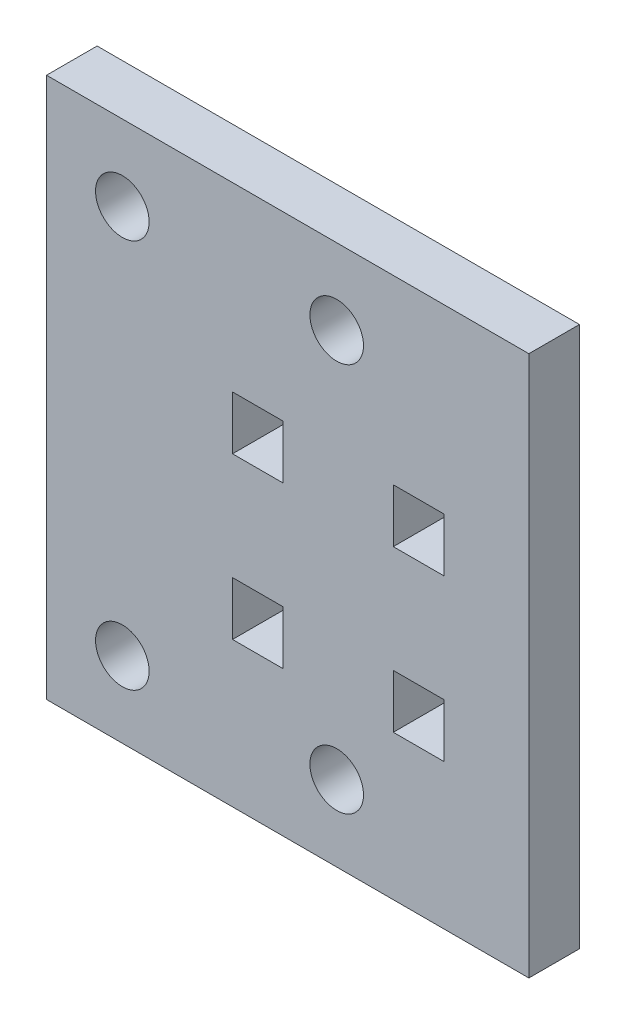
ISO-10303-21;
HEADER;
FILE_DESCRIPTION(('STEP AP214'),'2;1');
FILE_NAME('part.step','',(''),(''),'','','');
FILE_SCHEMA(('AUTOMOTIVE_DESIGN { 1 0 10303 214 1 1 1 1 }'));
ENDSEC;
DATA;
#1=APPLICATION_CONTEXT('core data for automotive mechanical design processes');
#2=APPLICATION_PROTOCOL_DEFINITION('international standard','automotive_design',2000,#1);
#3=PRODUCT_CONTEXT('',#1,'mechanical');
#4=PRODUCT('Part','Part','',(#3));
#5=PRODUCT_RELATED_PRODUCT_CATEGORY('part','',(#4));
#6=PRODUCT_DEFINITION_FORMATION('','',#4);
#7=PRODUCT_DEFINITION_CONTEXT('part definition',#1,'design');
#8=PRODUCT_DEFINITION('design','',#6,#7);
#9=PRODUCT_DEFINITION_SHAPE('','',#8);
#10=(LENGTH_UNIT() NAMED_UNIT(*) SI_UNIT(.MILLI.,.METRE.));
#11=(NAMED_UNIT(*) PLANE_ANGLE_UNIT() SI_UNIT($,.RADIAN.));
#12=(NAMED_UNIT(*) SI_UNIT($,.STERADIAN.) SOLID_ANGLE_UNIT());
#13=UNCERTAINTY_MEASURE_WITH_UNIT(LENGTH_MEASURE(1.E-05),#10,'distance_accuracy_value','');
#14=(GEOMETRIC_REPRESENTATION_CONTEXT(3) GLOBAL_UNCERTAINTY_ASSIGNED_CONTEXT((#13)) GLOBAL_UNIT_ASSIGNED_CONTEXT((#10,
#11,#12)) REPRESENTATION_CONTEXT('',''));
#15=CARTESIAN_POINT('',(0.,0.,0.));
#16=DIRECTION('',(0.,0.,1.));
#17=DIRECTION('',(1.,0.,0.));
#18=AXIS2_PLACEMENT_3D('',#15,#16,#17);
#19=CARTESIAN_POINT('',(0.,0.,5.9944));
#20=DIRECTION('',(0.,0.,-1.));
#21=DIRECTION('',(-1.,0.,0.));
#22=AXIS2_PLACEMENT_3D('',#19,#20,#21);
#23=PLANE('',#22);
#24=DIRECTION('',(0.,1.,0.));
#25=VECTOR('',#24,1.);
#26=CARTESIAN_POINT('',(-34.0795799365891,11.8820184368351,5.9944));
#27=LINE('',#26,#25);
#28=CARTESIAN_POINT('',(-34.0795799365891,5.53201843683511,5.9944));
#29=VERTEX_POINT('',#28);
#30=CARTESIAN_POINT('',(-34.0795799365891,11.8820184368351,5.9944));
#31=VERTEX_POINT('',#30);
#32=EDGE_CURVE('E204',#29,#31,#27,.T.);
#33=ORIENTED_EDGE('',*,*,#32,.F.);
#34=DIRECTION('',(1.,0.,0.));
#35=VECTOR('',#34,1.);
#36=CARTESIAN_POINT('',(-34.0795799365891,5.53201843683511,5.9944));
#37=LINE('',#36,#35);
#38=CARTESIAN_POINT('',(-40.0739799365892,5.53201843683511,5.9944));
#39=VERTEX_POINT('',#38);
#40=EDGE_CURVE('E212',#39,#29,#37,.T.);
#41=ORIENTED_EDGE('',*,*,#40,.F.);
#42=DIRECTION('',(0.,-1.,0.));
#43=VECTOR('',#42,1.);
#44=CARTESIAN_POINT('',(-40.0739799365892,5.53201843683511,5.9944));
#45=LINE('',#44,#43);
#46=CARTESIAN_POINT('',(-40.0739799365892,11.8820184368351,5.9944));
#47=VERTEX_POINT('',#46);
#48=EDGE_CURVE('E209',#47,#39,#45,.T.);
#49=ORIENTED_EDGE('',*,*,#48,.F.);
#50=DIRECTION('',(-1.,0.,0.));
#51=VECTOR('',#50,1.);
#52=CARTESIAN_POINT('',(-40.0739799365892,11.8820184368351,5.9944));
#53=LINE('',#52,#51);
#54=EDGE_CURVE('E206',#31,#47,#53,.T.);
#55=ORIENTED_EDGE('',*,*,#54,.F.);
#56=EDGE_LOOP('',(#33,#41,#49,#55));
#57=FACE_BOUND('',#56,.T.);
#58=CARTESIAN_POINT('',(-27.7295799365893,-21.71894001958,5.9944));
#59=DIRECTION('',(0.,0.,1.));
#60=DIRECTION('',(1.,0.,0.));
#61=AXIS2_PLACEMENT_3D('',#58,#59,#60);
#62=CIRCLE('',#61,3.175);
#63=CARTESIAN_POINT('',(-24.5545799365893,-21.71894001958,5.9944));
#64=VERTEX_POINT('',#63);
#65=EDGE_CURVE('E266',#64,#64,#62,.T.);
#66=ORIENTED_EDGE('',*,*,#65,.F.);
#67=EDGE_LOOP('',(#66));
#68=FACE_BOUND('',#67,.T.);
#69=CARTESIAN_POINT('',(-27.7295799365893,24.38105998042,5.9944));
#70=DIRECTION('',(0.,0.,1.));
#71=DIRECTION('',(1.,0.,0.));
#72=AXIS2_PLACEMENT_3D('',#69,#70,#71);
#73=CIRCLE('',#72,3.175);
#74=CARTESIAN_POINT('',(-24.5545799365893,24.38105998042,5.9944));
#75=VERTEX_POINT('',#74);
#76=EDGE_CURVE('E272',#75,#75,#73,.T.);
#77=ORIENTED_EDGE('',*,*,#76,.F.);
#78=EDGE_LOOP('',(#77));
#79=FACE_BOUND('',#78,.T.);
#80=CARTESIAN_POINT('',(-53.1295799365893,-21.71894001958,5.9944));
#81=DIRECTION('',(0.,0.,1.));
#82=DIRECTION('',(1.,0.,0.));
#83=AXIS2_PLACEMENT_3D('',#80,#81,#82);
#84=CIRCLE('',#83,3.175);
#85=CARTESIAN_POINT('',(-49.9545799365893,-21.71894001958,5.9944));
#86=VERTEX_POINT('',#85);
#87=EDGE_CURVE('E278',#86,#86,#84,.T.);
#88=ORIENTED_EDGE('',*,*,#87,.F.);
#89=EDGE_LOOP('',(#88));
#90=FACE_BOUND('',#89,.T.);
#91=CARTESIAN_POINT('',(-53.1295799365893,24.38105998042,5.9944));
#92=DIRECTION('',(0.,0.,1.));
#93=DIRECTION('',(1.,0.,0.));
#94=AXIS2_PLACEMENT_3D('',#91,#92,#93);
#95=CIRCLE('',#94,3.175);
#96=CARTESIAN_POINT('',(-49.9545799365893,24.38105998042,5.9944));
#97=VERTEX_POINT('',#96);
#98=EDGE_CURVE('E284',#97,#97,#95,.T.);
#99=ORIENTED_EDGE('',*,*,#98,.F.);
#100=EDGE_LOOP('',(#99));
#101=FACE_BOUND('',#100,.T.);
#102=DIRECTION('',(0.,1.,0.));
#103=VECTOR('',#102,1.);
#104=CARTESIAN_POINT('',(-15.0295799365894,-13.5179815627692,5.9944));
#105=LINE('',#104,#103);
#106=CARTESIAN_POINT('',(-15.0295799365894,-13.5179815627692,5.9944));
#107=VERTEX_POINT('',#106);
#108=CARTESIAN_POINT('',(-15.0295799365626,-7.1679815631649,5.9944));
#109=VERTEX_POINT('',#108);
#110=EDGE_CURVE('E290',#107,#109,#105,.T.);
#111=ORIENTED_EDGE('',*,*,#110,.F.);
#112=DIRECTION('',(1.,0.,0.));
#113=VECTOR('',#112,1.);
#114=CARTESIAN_POINT('',(-15.0295799365894,-13.5179815627692,5.9944));
#115=LINE('',#114,#113);
#116=CARTESIAN_POINT('',(-21.0239799365894,-13.5179815627692,5.9944));
#117=VERTEX_POINT('',#116);
#118=EDGE_CURVE('E298',#117,#107,#115,.T.);
#119=ORIENTED_EDGE('',*,*,#118,.F.);
#120=DIRECTION('',(-1.33178340761545E-10,-1.,0.));
#121=VECTOR('',#120,1.);
#122=CARTESIAN_POINT('',(-21.0239799365894,-7.36894001958005,5.9944));
#123=LINE('',#122,#121);
#124=CARTESIAN_POINT('',(-21.0239799365626,-7.1679815631649,5.9944));
#125=VERTEX_POINT('',#124);
#126=EDGE_CURVE('E295',#125,#117,#123,.T.);
#127=ORIENTED_EDGE('',*,*,#126,.F.);
#128=DIRECTION('',(-1.,0.,0.));
#129=VECTOR('',#128,1.);
#130=CARTESIAN_POINT('',(-15.0295799365626,-7.1679815631649,5.9944));
#131=LINE('',#130,#129);
#132=EDGE_CURVE('E292',#109,#125,#131,.T.);
#133=ORIENTED_EDGE('',*,*,#132,.F.);
#134=EDGE_LOOP('',(#111,#119,#127,#133));
#135=FACE_BOUND('',#134,.T.);
#136=DIRECTION('',(0.,1.,0.));
#137=VECTOR('',#136,1.);
#138=CARTESIAN_POINT('',(-4.95983605765846,33.3613161014891,5.9944));
#139=LINE('',#138,#137);
#140=CARTESIAN_POINT('',(-4.95983605765846,-30.6991961406492,5.9944));
#141=VERTEX_POINT('',#140);
#142=CARTESIAN_POINT('',(-4.95983605765846,33.3613161014891,5.9944));
#143=VERTEX_POINT('',#142);
#144=EDGE_CURVE('E320',#141,#143,#139,.T.);
#145=ORIENTED_EDGE('',*,*,#144,.T.);
#146=DIRECTION('',(-1.,0.,0.));
#147=VECTOR('',#146,1.);
#148=CARTESIAN_POINT('',(-62.1098360576585,33.3613161014891,5.9944));
#149=LINE('',#148,#147);
#150=CARTESIAN_POINT('',(-62.1098360576585,33.3613161014891,5.9944));
#151=VERTEX_POINT('',#150);
#152=EDGE_CURVE('E323',#143,#151,#149,.T.);
#153=ORIENTED_EDGE('',*,*,#152,.T.);
#154=DIRECTION('',(0.,-1.,0.));
#155=VECTOR('',#154,1.);
#156=CARTESIAN_POINT('',(-62.1098360576584,-30.6991961406492,5.9944));
#157=LINE('',#156,#155);
#158=CARTESIAN_POINT('',(-62.1098360576584,-30.6991961406492,5.9944));
#159=VERTEX_POINT('',#158);
#160=EDGE_CURVE('E326',#151,#159,#157,.T.);
#161=ORIENTED_EDGE('',*,*,#160,.T.);
#162=DIRECTION('',(1.,0.,0.));
#163=VECTOR('',#162,1.);
#164=CARTESIAN_POINT('',(-4.95983605765846,-30.6991961406492,5.9944));
#165=LINE('',#164,#163);
#166=EDGE_CURVE('E328',#159,#141,#165,.T.);
#167=ORIENTED_EDGE('',*,*,#166,.T.);
#168=EDGE_LOOP('',(#145,#153,#161,#167));
#169=FACE_BOUND('',#168,.T.);
#170=DIRECTION('',(-1.,0.,0.));
#171=VECTOR('',#170,1.);
#172=CARTESIAN_POINT('',(-15.0295799365626,11.8820184368351,5.9944));
#173=LINE('',#172,#171);
#174=CARTESIAN_POINT('',(-15.0295799365626,11.8820184368351,5.9944));
#175=VERTEX_POINT('',#174);
#176=CARTESIAN_POINT('',(-21.0239799365895,11.8820184368351,5.9944));
#177=VERTEX_POINT('',#176);
#178=EDGE_CURVE('E235',#175,#177,#173,.T.);
#179=ORIENTED_EDGE('',*,*,#178,.F.);
#180=DIRECTION('',(0.,1.,0.));
#181=VECTOR('',#180,1.);
#182=CARTESIAN_POINT('',(-15.0295799365626,5.53201843683511,5.9944));
#183=LINE('',#182,#181);
#184=CARTESIAN_POINT('',(-15.0295799365626,5.53201843683511,5.9944));
#185=VERTEX_POINT('',#184);
#186=EDGE_CURVE('E243',#185,#175,#183,.T.);
#187=ORIENTED_EDGE('',*,*,#186,.F.);
#188=DIRECTION('',(1.,0.,0.));
#189=VECTOR('',#188,1.);
#190=CARTESIAN_POINT('',(-21.0239799365626,5.53201843683511,5.9944));
#191=LINE('',#190,#189);
#192=CARTESIAN_POINT('',(-21.0239799365626,5.53201843683511,5.9944));
#193=VERTEX_POINT('',#192);
#194=EDGE_CURVE('E240',#193,#185,#191,.T.);
#195=ORIENTED_EDGE('',*,*,#194,.F.);
#196=DIRECTION('',(4.23217891178468E-12,-1.,0.));
#197=VECTOR('',#196,1.);
#198=CARTESIAN_POINT('',(-21.0239799365895,11.8820184368351,5.9944));
#199=LINE('',#198,#197);
#200=EDGE_CURVE('E237',#177,#193,#199,.T.);
#201=ORIENTED_EDGE('',*,*,#200,.F.);
#202=EDGE_LOOP('',(#179,#187,#195,#201));
#203=FACE_BOUND('',#202,.T.);
#204=DIRECTION('',(1.,0.,0.));
#205=VECTOR('',#204,1.);
#206=CARTESIAN_POINT('',(-40.0739799365892,-13.5179815627692,5.9944));
#207=LINE('',#206,#205);
#208=CARTESIAN_POINT('',(-40.0739799365892,-13.5179815627692,5.9944));
#209=VERTEX_POINT('',#208);
#210=CARTESIAN_POINT('',(-34.0795799365892,-13.5179815627692,5.9944));
#211=VERTEX_POINT('',#210);
#212=EDGE_CURVE('E172',#209,#211,#207,.T.);
#213=ORIENTED_EDGE('',*,*,#212,.F.);
#214=DIRECTION('',(0.,-1.,0.));
#215=VECTOR('',#214,1.);
#216=CARTESIAN_POINT('',(-40.0739799365892,-13.5179815627692,5.9944));
#217=LINE('',#216,#215);
#218=CARTESIAN_POINT('',(-40.0739799365891,-7.16798156276918,5.9944));
#219=VERTEX_POINT('',#218);
#220=EDGE_CURVE('E167',#219,#209,#217,.T.);
#221=ORIENTED_EDGE('',*,*,#220,.F.);
#222=DIRECTION('',(-1.,0.,0.));
#223=VECTOR('',#222,1.);
#224=CARTESIAN_POINT('',(-40.0739799365891,-7.16798156276918,5.9944));
#225=LINE('',#224,#223);
#226=CARTESIAN_POINT('',(-34.0795799365891,-7.16798156276918,5.9944));
#227=VERTEX_POINT('',#226);
#228=EDGE_CURVE('E188',#227,#219,#225,.T.);
#229=ORIENTED_EDGE('',*,*,#228,.F.);
#230=DIRECTION('',(0.,1.,0.));
#231=VECTOR('',#230,1.);
#232=CARTESIAN_POINT('',(-34.0795799365892,-13.5179815627692,5.9944));
#233=LINE('',#232,#231);
#234=EDGE_CURVE('E186',#211,#227,#233,.T.);
#235=ORIENTED_EDGE('',*,*,#234,.F.);
#236=EDGE_LOOP('',(#213,#221,#229,#235));
#237=FACE_BOUND('',#236,.T.);
#238=ADVANCED_FACE('F33',(#57,#68,#79,#90,#101,#135,#169,#203,#237),#23,.F.);
#239=CARTESIAN_POINT('',(0.,0.,0.));
#240=DIRECTION('',(0.,0.,-1.));
#241=DIRECTION('',(-1.,0.,0.));
#242=AXIS2_PLACEMENT_3D('',#239,#240,#241);
#243=PLANE('',#242);
#244=CARTESIAN_POINT('',(-27.7295799365893,24.38105998042,0.));
#245=DIRECTION('',(0.,0.,1.));
#246=DIRECTION('',(1.,0.,0.));
#247=AXIS2_PLACEMENT_3D('',#244,#245,#246);
#248=CIRCLE('',#247,3.175);
#249=CARTESIAN_POINT('',(-24.5545799365893,24.38105998042,0.));
#250=VERTEX_POINT('',#249);
#251=EDGE_CURVE('E269',#250,#250,#248,.T.);
#252=ORIENTED_EDGE('',*,*,#251,.T.);
#253=EDGE_LOOP('',(#252));
#254=FACE_BOUND('',#253,.T.);
#255=CARTESIAN_POINT('',(-53.1295799365893,24.38105998042,0.));
#256=DIRECTION('',(0.,0.,1.));
#257=DIRECTION('',(1.,0.,0.));
#258=AXIS2_PLACEMENT_3D('',#255,#256,#257);
#259=CIRCLE('',#258,3.175);
#260=CARTESIAN_POINT('',(-49.9545799365893,24.38105998042,0.));
#261=VERTEX_POINT('',#260);
#262=EDGE_CURVE('E281',#261,#261,#259,.T.);
#263=ORIENTED_EDGE('',*,*,#262,.T.);
#264=EDGE_LOOP('',(#263));
#265=FACE_BOUND('',#264,.T.);
#266=DIRECTION('',(0.,1.,0.));
#267=VECTOR('',#266,1.);
#268=CARTESIAN_POINT('',(-4.95983605765846,33.3613161014891,0.));
#269=LINE('',#268,#267);
#270=CARTESIAN_POINT('',(-4.95983605765846,-30.6991961406492,0.));
#271=VERTEX_POINT('',#270);
#272=CARTESIAN_POINT('',(-4.95983605765846,33.3613161014891,0.));
#273=VERTEX_POINT('',#272);
#274=EDGE_CURVE('E319',#271,#273,#269,.T.);
#275=ORIENTED_EDGE('',*,*,#274,.F.);
#276=DIRECTION('',(1.,0.,0.));
#277=VECTOR('',#276,1.);
#278=CARTESIAN_POINT('',(-4.95983605765846,-30.6991961406492,0.));
#279=LINE('',#278,#277);
#280=CARTESIAN_POINT('',(-62.1098360576584,-30.6991961406492,0.));
#281=VERTEX_POINT('',#280);
#282=EDGE_CURVE('E324',#281,#271,#279,.T.);
#283=ORIENTED_EDGE('',*,*,#282,.F.);
#284=DIRECTION('',(0.,-1.,0.));
#285=VECTOR('',#284,1.);
#286=CARTESIAN_POINT('',(-62.1098360576584,-30.6991961406492,0.));
#287=LINE('',#286,#285);
#288=CARTESIAN_POINT('',(-62.1098360576585,33.3613161014891,0.));
#289=VERTEX_POINT('',#288);
#290=EDGE_CURVE('E335',#289,#281,#287,.T.);
#291=ORIENTED_EDGE('',*,*,#290,.F.);
#292=DIRECTION('',(-1.,0.,0.));
#293=VECTOR('',#292,1.);
#294=CARTESIAN_POINT('',(-62.1098360576585,33.3613161014891,0.));
#295=LINE('',#294,#293);
#296=EDGE_CURVE('E333',#273,#289,#295,.T.);
#297=ORIENTED_EDGE('',*,*,#296,.F.);
#298=EDGE_LOOP('',(#275,#283,#291,#297));
#299=FACE_BOUND('',#298,.T.);
#300=DIRECTION('',(1.,0.,0.));
#301=VECTOR('',#300,1.);
#302=CARTESIAN_POINT('',(-15.0295799365894,-13.5179815627692,0.));
#303=LINE('',#302,#301);
#304=CARTESIAN_POINT('',(-21.0239799365894,-13.5179815627692,0.));
#305=VERTEX_POINT('',#304);
#306=CARTESIAN_POINT('',(-15.0295799365894,-13.5179815627692,0.));
#307=VERTEX_POINT('',#306);
#308=EDGE_CURVE('E293',#305,#307,#303,.T.);
#309=ORIENTED_EDGE('',*,*,#308,.T.);
#310=DIRECTION('',(1.33169708512337E-10,1.,0.));
#311=VECTOR('',#310,1.);
#312=CARTESIAN_POINT('',(-15.0295799365894,-7.36894001958005,0.));
#313=LINE('',#312,#311);
#314=CARTESIAN_POINT('',(-15.0295799365626,-7.1679815631649,0.));
#315=VERTEX_POINT('',#314);
#316=EDGE_CURVE('E287',#307,#315,#313,.T.);
#317=ORIENTED_EDGE('',*,*,#316,.T.);
#318=DIRECTION('',(-1.,0.,0.));
#319=VECTOR('',#318,1.);
#320=CARTESIAN_POINT('',(-15.0295799365626,-7.1679815631649,0.));
#321=LINE('',#320,#319);
#322=CARTESIAN_POINT('',(-21.0239799365626,-7.1679815631649,0.));
#323=VERTEX_POINT('',#322);
#324=EDGE_CURVE('E303',#315,#323,#321,.T.);
#325=ORIENTED_EDGE('',*,*,#324,.T.);
#326=DIRECTION('',(0.,-1.,0.));
#327=VECTOR('',#326,1.);
#328=CARTESIAN_POINT('',(-21.0239799365894,-13.5179815627692,0.));
#329=LINE('',#328,#327);
#330=EDGE_CURVE('E306',#323,#305,#329,.T.);
#331=ORIENTED_EDGE('',*,*,#330,.T.);
#332=EDGE_LOOP('',(#309,#317,#325,#331));
#333=FACE_BOUND('',#332,.T.);
#334=CARTESIAN_POINT('',(-53.1295799365893,-21.71894001958,0.));
#335=DIRECTION('',(0.,0.,1.));
#336=DIRECTION('',(1.,0.,0.));
#337=AXIS2_PLACEMENT_3D('',#334,#335,#336);
#338=CIRCLE('',#337,3.175);
#339=CARTESIAN_POINT('',(-49.9545799365893,-21.71894001958,0.));
#340=VERTEX_POINT('',#339);
#341=EDGE_CURVE('E275',#340,#340,#338,.T.);
#342=ORIENTED_EDGE('',*,*,#341,.T.);
#343=EDGE_LOOP('',(#342));
#344=FACE_BOUND('',#343,.T.);
#345=CARTESIAN_POINT('',(-27.7295799365893,-21.71894001958,0.));
#346=DIRECTION('',(0.,0.,1.));
#347=DIRECTION('',(1.,0.,0.));
#348=AXIS2_PLACEMENT_3D('',#345,#346,#347);
#349=CIRCLE('',#348,3.175);
#350=CARTESIAN_POINT('',(-24.5545799365893,-21.71894001958,0.));
#351=VERTEX_POINT('',#350);
#352=EDGE_CURVE('E265',#351,#351,#349,.T.);
#353=ORIENTED_EDGE('',*,*,#352,.T.);
#354=EDGE_LOOP('',(#353));
#355=FACE_BOUND('',#354,.T.);
#356=DIRECTION('',(0.,1.,0.));
#357=VECTOR('',#356,1.);
#358=CARTESIAN_POINT('',(-15.0295799365626,5.53201843683511,0.));
#359=LINE('',#358,#357);
#360=CARTESIAN_POINT('',(-15.0295799365626,5.53201843683511,0.));
#361=VERTEX_POINT('',#360);
#362=CARTESIAN_POINT('',(-15.0295799365626,11.8820184368351,0.));
#363=VERTEX_POINT('',#362);
#364=EDGE_CURVE('E238',#361,#363,#359,.T.);
#365=ORIENTED_EDGE('',*,*,#364,.T.);
#366=DIRECTION('',(-1.,0.,0.));
#367=VECTOR('',#366,1.);
#368=CARTESIAN_POINT('',(-15.0295799365626,11.8820184368351,0.));
#369=LINE('',#368,#367);
#370=CARTESIAN_POINT('',(-21.0239799365895,11.8820184368351,0.));
#371=VERTEX_POINT('',#370);
#372=EDGE_CURVE('E234',#363,#371,#369,.T.);
#373=ORIENTED_EDGE('',*,*,#372,.T.);
#374=DIRECTION('',(4.23217891178468E-12,-1.,0.));
#375=VECTOR('',#374,1.);
#376=CARTESIAN_POINT('',(-21.0239799365895,11.8820184368351,0.));
#377=LINE('',#376,#375);
#378=CARTESIAN_POINT('',(-21.0239799365626,5.53201843683511,0.));
#379=VERTEX_POINT('',#378);
#380=EDGE_CURVE('E248',#371,#379,#377,.T.);
#381=ORIENTED_EDGE('',*,*,#380,.T.);
#382=DIRECTION('',(1.,0.,0.));
#383=VECTOR('',#382,1.);
#384=CARTESIAN_POINT('',(-21.0239799365626,5.53201843683511,0.));
#385=LINE('',#384,#383);
#386=EDGE_CURVE('E251',#379,#361,#385,.T.);
#387=ORIENTED_EDGE('',*,*,#386,.T.);
#388=EDGE_LOOP('',(#365,#373,#381,#387));
#389=FACE_BOUND('',#388,.T.);
#390=DIRECTION('',(1.,0.,0.));
#391=VECTOR('',#390,1.);
#392=CARTESIAN_POINT('',(-34.0795799365891,5.53201843683511,0.));
#393=LINE('',#392,#391);
#394=CARTESIAN_POINT('',(-40.0739799365892,5.53201843683511,0.));
#395=VERTEX_POINT('',#394);
#396=CARTESIAN_POINT('',(-34.0795799365891,5.53201843683511,0.));
#397=VERTEX_POINT('',#396);
#398=EDGE_CURVE('E207',#395,#397,#393,.T.);
#399=ORIENTED_EDGE('',*,*,#398,.T.);
#400=DIRECTION('',(0.,1.,0.));
#401=VECTOR('',#400,1.);
#402=CARTESIAN_POINT('',(-34.0795799365891,11.8820184368351,0.));
#403=LINE('',#402,#401);
#404=CARTESIAN_POINT('',(-34.0795799365891,11.8820184368351,0.));
#405=VERTEX_POINT('',#404);
#406=EDGE_CURVE('E182',#397,#405,#403,.T.);
#407=ORIENTED_EDGE('',*,*,#406,.T.);
#408=DIRECTION('',(-1.,0.,0.));
#409=VECTOR('',#408,1.);
#410=CARTESIAN_POINT('',(-40.0739799365892,11.8820184368351,0.));
#411=LINE('',#410,#409);
#412=CARTESIAN_POINT('',(-40.0739799365892,11.8820184368351,0.));
#413=VERTEX_POINT('',#412);
#414=EDGE_CURVE('E217',#405,#413,#411,.T.);
#415=ORIENTED_EDGE('',*,*,#414,.T.);
#416=DIRECTION('',(0.,-1.,0.));
#417=VECTOR('',#416,1.);
#418=CARTESIAN_POINT('',(-40.0739799365892,5.53201843683511,0.));
#419=LINE('',#418,#417);
#420=EDGE_CURVE('E220',#413,#395,#419,.T.);
#421=ORIENTED_EDGE('',*,*,#420,.T.);
#422=EDGE_LOOP('',(#399,#407,#415,#421));
#423=FACE_BOUND('',#422,.T.);
#424=DIRECTION('',(-5.17934951384329E-13,-1.,0.));
#425=VECTOR('',#424,1.);
#426=CARTESIAN_POINT('',(-40.0739799365892,-7.36894001958005,0.));
#427=LINE('',#426,#425);
#428=CARTESIAN_POINT('',(-40.0739799365891,-7.16798156276918,0.));
#429=VERTEX_POINT('',#428);
#430=CARTESIAN_POINT('',(-40.0739799365924,-13.5179815627692,0.));
#431=VERTEX_POINT('',#430);
#432=EDGE_CURVE('E173',#429,#431,#427,.T.);
#433=ORIENTED_EDGE('',*,*,#432,.T.);
#434=DIRECTION('',(1.,0.,0.));
#435=VECTOR('',#434,1.);
#436=CARTESIAN_POINT('',(-40.0739799365892,-13.5179815627692,0.));
#437=LINE('',#436,#435);
#438=CARTESIAN_POINT('',(-34.0795799365892,-13.5179815627692,0.));
#439=VERTEX_POINT('',#438);
#440=EDGE_CURVE('E180',#431,#439,#437,.T.);
#441=ORIENTED_EDGE('',*,*,#440,.T.);
#442=DIRECTION('',(5.17934951384333E-13,1.,0.));
#443=VECTOR('',#442,1.);
#444=CARTESIAN_POINT('',(-34.0795799365892,-7.36894001958005,0.));
#445=LINE('',#444,#443);
#446=CARTESIAN_POINT('',(-34.0795799365891,-7.16798156276918,0.));
#447=VERTEX_POINT('',#446);
#448=EDGE_CURVE('E193',#439,#447,#445,.T.);
#449=ORIENTED_EDGE('',*,*,#448,.T.);
#450=DIRECTION('',(-1.,0.,0.));
#451=VECTOR('',#450,1.);
#452=CARTESIAN_POINT('',(-40.0739799365891,-7.16798156276918,0.));
#453=LINE('',#452,#451);
#454=EDGE_CURVE('E196',#447,#429,#453,.T.);
#455=ORIENTED_EDGE('',*,*,#454,.T.);
#456=EDGE_LOOP('',(#433,#441,#449,#455));
#457=FACE_BOUND('',#456,.T.);
#458=ADVANCED_FACE('F353',(#254,#265,#299,#333,#344,#355,#389,#423,#457),#243,.T.);
#459=CARTESIAN_POINT('',(-4.95983605765846,33.3613161014891,5.9944));
#460=DIRECTION('',(-1.,0.,0.));
#461=DIRECTION('',(0.,0.,1.));
#462=AXIS2_PLACEMENT_3D('',#459,#460,#461);
#463=PLANE('',#462);
#464=ORIENTED_EDGE('',*,*,#274,.T.);
#465=DIRECTION('',(0.,0.,-1.));
#466=VECTOR('',#465,1.);
#467=CARTESIAN_POINT('',(-4.95983605765846,33.3613161014891,5.9944));
#468=LINE('',#467,#466);
#469=EDGE_CURVE('E11',#143,#273,#468,.T.);
#470=ORIENTED_EDGE('',*,*,#469,.F.);
#471=ORIENTED_EDGE('',*,*,#144,.F.);
#472=DIRECTION('',(0.,0.,-1.));
#473=VECTOR('',#472,1.);
#474=CARTESIAN_POINT('',(-4.95983605765846,-30.6991961406492,5.9944));
#475=LINE('',#474,#473);
#476=EDGE_CURVE('E330',#141,#271,#475,.T.);
#477=ORIENTED_EDGE('',*,*,#476,.T.);
#478=EDGE_LOOP('',(#464,#470,#471,#477));
#479=FACE_BOUND('',#478,.T.);
#480=ADVANCED_FACE('F35',(#479),#463,.F.);
#481=CARTESIAN_POINT('',(-62.1098360576585,33.3613161014891,5.9944));
#482=DIRECTION('',(0.,-1.,0.));
#483=DIRECTION('',(1.,0.,0.));
#484=AXIS2_PLACEMENT_3D('',#481,#482,#483);
#485=PLANE('',#484);
#486=ORIENTED_EDGE('',*,*,#296,.T.);
#487=DIRECTION('',(0.,0.,-1.));
#488=VECTOR('',#487,1.);
#489=CARTESIAN_POINT('',(-62.1098360576585,33.3613161014891,5.9944));
#490=LINE('',#489,#488);
#491=EDGE_CURVE('E41',#151,#289,#490,.T.);
#492=ORIENTED_EDGE('',*,*,#491,.F.);
#493=ORIENTED_EDGE('',*,*,#152,.F.);
#494=ORIENTED_EDGE('',*,*,#469,.T.);
#495=EDGE_LOOP('',(#486,#492,#493,#494));
#496=FACE_BOUND('',#495,.T.);
#497=ADVANCED_FACE('F364',(#496),#485,.F.);
#498=CARTESIAN_POINT('',(-62.1098360576584,-30.6991961406492,5.9944));
#499=DIRECTION('',(1.,0.,0.));
#500=DIRECTION('',(0.,1.,0.));
#501=AXIS2_PLACEMENT_3D('',#498,#499,#500);
#502=PLANE('',#501);
#503=ORIENTED_EDGE('',*,*,#290,.T.);
#504=DIRECTION('',(0.,0.,-1.));
#505=VECTOR('',#504,1.);
#506=CARTESIAN_POINT('',(-62.1098360576584,-30.6991961406492,5.9944));
#507=LINE('',#506,#505);
#508=EDGE_CURVE('E340',#159,#281,#507,.T.);
#509=ORIENTED_EDGE('',*,*,#508,.F.);
#510=ORIENTED_EDGE('',*,*,#160,.F.);
#511=ORIENTED_EDGE('',*,*,#491,.T.);
#512=EDGE_LOOP('',(#503,#509,#510,#511));
#513=FACE_BOUND('',#512,.T.);
#514=ADVANCED_FACE('F347',(#513),#502,.F.);
#515=CARTESIAN_POINT('',(-4.95983605765846,-30.6991961406492,5.9944));
#516=DIRECTION('',(0.,1.,0.));
#517=DIRECTION('',(0.,0.,1.));
#518=AXIS2_PLACEMENT_3D('',#515,#516,#517);
#519=PLANE('',#518);
#520=ORIENTED_EDGE('',*,*,#282,.T.);
#521=ORIENTED_EDGE('',*,*,#476,.F.);
#522=ORIENTED_EDGE('',*,*,#166,.F.);
#523=ORIENTED_EDGE('',*,*,#508,.T.);
#524=EDGE_LOOP('',(#520,#521,#522,#523));
#525=FACE_BOUND('',#524,.T.);
#526=ADVANCED_FACE('F357',(#525),#519,.F.);
#527=CARTESIAN_POINT('',(-15.0295799365894,-7.36894001958005,5.9944));
#528=DIRECTION('',(-1.,1.33169708512337E-10,0.));
#529=DIRECTION('',(-1.33169708512337E-10,-1.,0.));
#530=AXIS2_PLACEMENT_3D('',#527,#528,#529);
#531=PLANE('',#530);
#532=ORIENTED_EDGE('',*,*,#316,.F.);
#533=DIRECTION('',(0.,0.,-1.));
#534=VECTOR('',#533,1.);
#535=CARTESIAN_POINT('',(-15.0295799365894,-13.5179815627692,5.9944));
#536=LINE('',#535,#534);
#537=EDGE_CURVE('E300',#107,#307,#536,.T.);
#538=ORIENTED_EDGE('',*,*,#537,.F.);
#539=ORIENTED_EDGE('',*,*,#110,.T.);
#540=DIRECTION('',(0.,0.,-1.));
#541=VECTOR('',#540,1.);
#542=CARTESIAN_POINT('',(-15.0295799365626,-7.1679815631649,5.9944));
#543=LINE('',#542,#541);
#544=EDGE_CURVE('E317',#109,#315,#543,.T.);
#545=ORIENTED_EDGE('',*,*,#544,.T.);
#546=EDGE_LOOP('',(#532,#538,#539,#545));
#547=FACE_BOUND('',#546,.T.);
#548=ADVANCED_FACE('F382',(#547),#531,.T.);
#549=CARTESIAN_POINT('',(-15.0295799365626,-7.1679815631649,5.9944));
#550=DIRECTION('',(0.,-1.,0.));
#551=DIRECTION('',(1.,0.,0.));
#552=AXIS2_PLACEMENT_3D('',#549,#550,#551);
#553=PLANE('',#552);
#554=ORIENTED_EDGE('',*,*,#324,.F.);
#555=ORIENTED_EDGE('',*,*,#544,.F.);
#556=ORIENTED_EDGE('',*,*,#132,.T.);
#557=DIRECTION('',(0.,0.,-1.));
#558=VECTOR('',#557,1.);
#559=CARTESIAN_POINT('',(-21.0239799365626,-7.1679815631649,5.9944));
#560=LINE('',#559,#558);
#561=EDGE_CURVE('E314',#125,#323,#560,.T.);
#562=ORIENTED_EDGE('',*,*,#561,.T.);
#563=EDGE_LOOP('',(#554,#555,#556,#562));
#564=FACE_BOUND('',#563,.T.);
#565=ADVANCED_FACE('F389',(#564),#553,.T.);
#566=CARTESIAN_POINT('',(-21.0239799365894,-13.5179815627692,5.9944));
#567=DIRECTION('',(1.,0.,0.));
#568=DIRECTION('',(0.,0.,-1.));
#569=AXIS2_PLACEMENT_3D('',#566,#567,#568);
#570=PLANE('',#569);
#571=ORIENTED_EDGE('',*,*,#330,.F.);
#572=ORIENTED_EDGE('',*,*,#561,.F.);
#573=ORIENTED_EDGE('',*,*,#126,.T.);
#574=DIRECTION('',(0.,0.,-1.));
#575=VECTOR('',#574,1.);
#576=CARTESIAN_POINT('',(-21.0239799365894,-13.5179815627692,5.9944));
#577=LINE('',#576,#575);
#578=EDGE_CURVE('E312',#117,#305,#577,.T.);
#579=ORIENTED_EDGE('',*,*,#578,.T.);
#580=EDGE_LOOP('',(#571,#572,#573,#579));
#581=FACE_BOUND('',#580,.T.);
#582=ADVANCED_FACE('F394',(#581),#570,.T.);
#583=CARTESIAN_POINT('',(-15.0295799365894,-13.5179815627692,5.9944));
#584=DIRECTION('',(0.,1.,0.));
#585=DIRECTION('',(0.,0.,1.));
#586=AXIS2_PLACEMENT_3D('',#583,#584,#585);
#587=PLANE('',#586);
#588=ORIENTED_EDGE('',*,*,#308,.F.);
#589=ORIENTED_EDGE('',*,*,#578,.F.);
#590=ORIENTED_EDGE('',*,*,#118,.T.);
#591=ORIENTED_EDGE('',*,*,#537,.T.);
#592=EDGE_LOOP('',(#588,#589,#590,#591));
#593=FACE_BOUND('',#592,.T.);
#594=ADVANCED_FACE('F404',(#593),#587,.T.);
#595=CARTESIAN_POINT('',(-53.1295799365893,24.38105998042,5.9944));
#596=DIRECTION('',(0.,0.,-1.));
#597=DIRECTION('',(-1.,0.,0.));
#598=AXIS2_PLACEMENT_3D('',#595,#596,#597);
#599=CYLINDRICAL_SURFACE('',#598,3.175);
#600=ORIENTED_EDGE('',*,*,#98,.T.);
#601=EDGE_LOOP('',(#600));
#602=FACE_BOUND('',#601,.T.);
#603=ORIENTED_EDGE('',*,*,#262,.F.);
#604=EDGE_LOOP('',(#603));
#605=FACE_BOUND('',#604,.T.);
#606=ADVANCED_FACE('F416',(#602,#605),#599,.F.);
#607=CARTESIAN_POINT('',(-53.1295799365893,-21.71894001958,5.9944));
#608=DIRECTION('',(0.,0.,-1.));
#609=DIRECTION('',(-1.,0.,0.));
#610=AXIS2_PLACEMENT_3D('',#607,#608,#609);
#611=CYLINDRICAL_SURFACE('',#610,3.175);
#612=ORIENTED_EDGE('',*,*,#87,.T.);
#613=EDGE_LOOP('',(#612));
#614=FACE_BOUND('',#613,.T.);
#615=ORIENTED_EDGE('',*,*,#341,.F.);
#616=EDGE_LOOP('',(#615));
#617=FACE_BOUND('',#616,.T.);
#618=ADVANCED_FACE('F421',(#614,#617),#611,.F.);
#619=CARTESIAN_POINT('',(-27.7295799365893,24.38105998042,5.9944));
#620=DIRECTION('',(0.,0.,-1.));
#621=DIRECTION('',(-1.,0.,0.));
#622=AXIS2_PLACEMENT_3D('',#619,#620,#621);
#623=CYLINDRICAL_SURFACE('',#622,3.175);
#624=ORIENTED_EDGE('',*,*,#76,.T.);
#625=EDGE_LOOP('',(#624));
#626=FACE_BOUND('',#625,.T.);
#627=ORIENTED_EDGE('',*,*,#251,.F.);
#628=EDGE_LOOP('',(#627));
#629=FACE_BOUND('',#628,.T.);
#630=ADVANCED_FACE('F425',(#626,#629),#623,.F.);
#631=CARTESIAN_POINT('',(-27.7295799365893,-21.71894001958,5.9944));
#632=DIRECTION('',(0.,0.,-1.));
#633=DIRECTION('',(-1.,0.,0.));
#634=AXIS2_PLACEMENT_3D('',#631,#632,#633);
#635=CYLINDRICAL_SURFACE('',#634,3.175);
#636=ORIENTED_EDGE('',*,*,#65,.T.);
#637=EDGE_LOOP('',(#636));
#638=FACE_BOUND('',#637,.T.);
#639=ORIENTED_EDGE('',*,*,#352,.F.);
#640=EDGE_LOOP('',(#639));
#641=FACE_BOUND('',#640,.T.);
#642=ADVANCED_FACE('F429',(#638,#641),#635,.F.);
#643=CARTESIAN_POINT('',(-15.0295799365626,11.8820184368351,5.9944));
#644=DIRECTION('',(0.,-1.,0.));
#645=DIRECTION('',(0.,0.,-1.));
#646=AXIS2_PLACEMENT_3D('',#643,#644,#645);
#647=PLANE('',#646);
#648=ORIENTED_EDGE('',*,*,#372,.F.);
#649=DIRECTION('',(0.,0.,-1.));
#650=VECTOR('',#649,1.);
#651=CARTESIAN_POINT('',(-15.0295799365626,11.8820184368351,5.9944));
#652=LINE('',#651,#650);
#653=EDGE_CURVE('E245',#175,#363,#652,.T.);
#654=ORIENTED_EDGE('',*,*,#653,.F.);
#655=ORIENTED_EDGE('',*,*,#178,.T.);
#656=DIRECTION('',(0.,0.,-1.));
#657=VECTOR('',#656,1.);
#658=CARTESIAN_POINT('',(-21.0239799365895,11.8820184368351,5.9944));
#659=LINE('',#658,#657);
#660=EDGE_CURVE('E262',#177,#371,#659,.T.);
#661=ORIENTED_EDGE('',*,*,#660,.T.);
#662=EDGE_LOOP('',(#648,#654,#655,#661));
#663=FACE_BOUND('',#662,.T.);
#664=ADVANCED_FACE('F433',(#663),#647,.T.);
#665=CARTESIAN_POINT('',(-21.0239799365895,11.8820184368351,5.9944));
#666=DIRECTION('',(1.,4.23217891178468E-12,0.));
#667=DIRECTION('',(-4.23217891178468E-12,1.,0.));
#668=AXIS2_PLACEMENT_3D('',#665,#666,#667);
#669=PLANE('',#668);
#670=ORIENTED_EDGE('',*,*,#380,.F.);
#671=ORIENTED_EDGE('',*,*,#660,.F.);
#672=ORIENTED_EDGE('',*,*,#200,.T.);
#673=DIRECTION('',(0.,0.,-1.));
#674=VECTOR('',#673,1.);
#675=CARTESIAN_POINT('',(-21.0239799365626,5.53201843683511,5.9944));
#676=LINE('',#675,#674);
#677=EDGE_CURVE('E260',#193,#379,#676,.T.);
#678=ORIENTED_EDGE('',*,*,#677,.T.);
#679=EDGE_LOOP('',(#670,#671,#672,#678));
#680=FACE_BOUND('',#679,.T.);
#681=ADVANCED_FACE('F437',(#680),#669,.T.);
#682=CARTESIAN_POINT('',(-21.0239799365626,5.53201843683511,5.9944));
#683=DIRECTION('',(0.,1.,0.));
#684=DIRECTION('',(-1.,0.,0.));
#685=AXIS2_PLACEMENT_3D('',#682,#683,#684);
#686=PLANE('',#685);
#687=ORIENTED_EDGE('',*,*,#386,.F.);
#688=ORIENTED_EDGE('',*,*,#677,.F.);
#689=ORIENTED_EDGE('',*,*,#194,.T.);
#690=DIRECTION('',(0.,0.,-1.));
#691=VECTOR('',#690,1.);
#692=CARTESIAN_POINT('',(-15.0295799365626,5.53201843683511,5.9944));
#693=LINE('',#692,#691);
#694=EDGE_CURVE('E258',#185,#361,#693,.T.);
#695=ORIENTED_EDGE('',*,*,#694,.T.);
#696=EDGE_LOOP('',(#687,#688,#689,#695));
#697=FACE_BOUND('',#696,.T.);
#698=ADVANCED_FACE('F441',(#697),#686,.T.);
#699=CARTESIAN_POINT('',(-15.0295799365626,5.53201843683511,5.9944));
#700=DIRECTION('',(-1.,0.,0.));
#701=DIRECTION('',(0.,0.,1.));
#702=AXIS2_PLACEMENT_3D('',#699,#700,#701);
#703=PLANE('',#702);
#704=ORIENTED_EDGE('',*,*,#364,.F.);
#705=ORIENTED_EDGE('',*,*,#694,.F.);
#706=ORIENTED_EDGE('',*,*,#186,.T.);
#707=ORIENTED_EDGE('',*,*,#653,.T.);
#708=EDGE_LOOP('',(#704,#705,#706,#707));
#709=FACE_BOUND('',#708,.T.);
#710=ADVANCED_FACE('F445',(#709),#703,.T.);
#711=CARTESIAN_POINT('',(-34.0795799365891,11.8820184368351,5.9944));
#712=DIRECTION('',(-1.,0.,0.));
#713=DIRECTION('',(0.,0.,1.));
#714=AXIS2_PLACEMENT_3D('',#711,#712,#713);
#715=PLANE('',#714);
#716=ORIENTED_EDGE('',*,*,#406,.F.);
#717=DIRECTION('',(0.,0.,-1.));
#718=VECTOR('',#717,1.);
#719=CARTESIAN_POINT('',(-34.0795799365891,5.53201843683511,5.9944));
#720=LINE('',#719,#718);
#721=EDGE_CURVE('E214',#29,#397,#720,.T.);
#722=ORIENTED_EDGE('',*,*,#721,.F.);
#723=ORIENTED_EDGE('',*,*,#32,.T.);
#724=DIRECTION('',(0.,0.,-1.));
#725=VECTOR('',#724,1.);
#726=CARTESIAN_POINT('',(-34.0795799365891,11.8820184368351,5.9944));
#727=LINE('',#726,#725);
#728=EDGE_CURVE('E231',#31,#405,#727,.T.);
#729=ORIENTED_EDGE('',*,*,#728,.T.);
#730=EDGE_LOOP('',(#716,#722,#723,#729));
#731=FACE_BOUND('',#730,.T.);
#732=ADVANCED_FACE('F449',(#731),#715,.T.);
#733=CARTESIAN_POINT('',(-40.0739799365892,11.8820184368351,5.9944));
#734=DIRECTION('',(0.,-1.,0.));
#735=DIRECTION('',(1.,0.,0.));
#736=AXIS2_PLACEMENT_3D('',#733,#734,#735);
#737=PLANE('',#736);
#738=ORIENTED_EDGE('',*,*,#414,.F.);
#739=ORIENTED_EDGE('',*,*,#728,.F.);
#740=ORIENTED_EDGE('',*,*,#54,.T.);
#741=DIRECTION('',(0.,0.,-1.));
#742=VECTOR('',#741,1.);
#743=CARTESIAN_POINT('',(-40.0739799365892,11.8820184368351,5.9944));
#744=LINE('',#743,#742);
#745=EDGE_CURVE('E229',#47,#413,#744,.T.);
#746=ORIENTED_EDGE('',*,*,#745,.T.);
#747=EDGE_LOOP('',(#738,#739,#740,#746));
#748=FACE_BOUND('',#747,.T.);
#749=ADVANCED_FACE('F453',(#748),#737,.T.);
#750=CARTESIAN_POINT('',(-40.0739799365892,5.53201843683511,5.9944));
#751=DIRECTION('',(1.,0.,0.));
#752=DIRECTION('',(0.,0.,-1.));
#753=AXIS2_PLACEMENT_3D('',#750,#751,#752);
#754=PLANE('',#753);
#755=ORIENTED_EDGE('',*,*,#420,.F.);
#756=ORIENTED_EDGE('',*,*,#745,.F.);
#757=ORIENTED_EDGE('',*,*,#48,.T.);
#758=DIRECTION('',(0.,0.,-1.));
#759=VECTOR('',#758,1.);
#760=CARTESIAN_POINT('',(-40.0739799365892,5.53201843683511,5.9944));
#761=LINE('',#760,#759);
#762=EDGE_CURVE('E227',#39,#395,#761,.T.);
#763=ORIENTED_EDGE('',*,*,#762,.T.);
#764=EDGE_LOOP('',(#755,#756,#757,#763));
#765=FACE_BOUND('',#764,.T.);
#766=ADVANCED_FACE('F457',(#765),#754,.T.);
#767=CARTESIAN_POINT('',(-34.0795799365891,5.53201843683511,5.9944));
#768=DIRECTION('',(0.,1.,0.));
#769=DIRECTION('',(0.,0.,1.));
#770=AXIS2_PLACEMENT_3D('',#767,#768,#769);
#771=PLANE('',#770);
#772=ORIENTED_EDGE('',*,*,#398,.F.);
#773=ORIENTED_EDGE('',*,*,#762,.F.);
#774=ORIENTED_EDGE('',*,*,#40,.T.);
#775=ORIENTED_EDGE('',*,*,#721,.T.);
#776=EDGE_LOOP('',(#772,#773,#774,#775));
#777=FACE_BOUND('',#776,.T.);
#778=ADVANCED_FACE('F461',(#777),#771,.T.);
#779=CARTESIAN_POINT('',(-40.0739799365892,-13.5179815627692,5.9944));
#780=DIRECTION('',(0.,1.,0.));
#781=DIRECTION('',(0.,0.,1.));
#782=AXIS2_PLACEMENT_3D('',#779,#780,#781);
#783=PLANE('',#782);
#784=ORIENTED_EDGE('',*,*,#440,.F.);
#785=DIRECTION('',(0.,0.,-1.));
#786=VECTOR('',#785,1.);
#787=CARTESIAN_POINT('',(-40.0739799365892,-13.5179815627692,5.9944));
#788=LINE('',#787,#786);
#789=EDGE_CURVE('E53',#209,#431,#788,.T.);
#790=ORIENTED_EDGE('',*,*,#789,.F.);
#791=ORIENTED_EDGE('',*,*,#212,.T.);
#792=DIRECTION('',(0.,0.,-1.));
#793=VECTOR('',#792,1.);
#794=CARTESIAN_POINT('',(-34.0795799365892,-13.5179815627692,5.9944));
#795=LINE('',#794,#793);
#796=EDGE_CURVE('E183',#211,#439,#795,.T.);
#797=ORIENTED_EDGE('',*,*,#796,.T.);
#798=EDGE_LOOP('',(#784,#790,#791,#797));
#799=FACE_BOUND('',#798,.T.);
#800=ADVANCED_FACE('F176',(#799),#783,.T.);
#801=CARTESIAN_POINT('',(-34.0795799365892,-7.36894001958005,5.9944));
#802=DIRECTION('',(-1.,5.17934951384333E-13,0.));
#803=DIRECTION('',(-5.17934951384333E-13,-1.,0.));
#804=AXIS2_PLACEMENT_3D('',#801,#802,#803);
#805=PLANE('',#804);
#806=ORIENTED_EDGE('',*,*,#448,.F.);
#807=ORIENTED_EDGE('',*,*,#796,.F.);
#808=ORIENTED_EDGE('',*,*,#234,.T.);
#809=DIRECTION('',(0.,0.,-1.));
#810=VECTOR('',#809,1.);
#811=CARTESIAN_POINT('',(-34.0795799365891,-7.16798156276918,5.9944));
#812=LINE('',#811,#810);
#813=EDGE_CURVE('E201',#227,#447,#812,.T.);
#814=ORIENTED_EDGE('',*,*,#813,.T.);
#815=EDGE_LOOP('',(#806,#807,#808,#814));
#816=FACE_BOUND('',#815,.T.);
#817=ADVANCED_FACE('F468',(#816),#805,.T.);
#818=CARTESIAN_POINT('',(-40.0739799365891,-7.16798156276918,5.9944));
#819=DIRECTION('',(0.,-1.,0.));
#820=DIRECTION('',(1.,0.,0.));
#821=AXIS2_PLACEMENT_3D('',#818,#819,#820);
#822=PLANE('',#821);
#823=ORIENTED_EDGE('',*,*,#454,.F.);
#824=ORIENTED_EDGE('',*,*,#813,.F.);
#825=ORIENTED_EDGE('',*,*,#228,.T.);
#826=DIRECTION('',(0.,0.,-1.));
#827=VECTOR('',#826,1.);
#828=CARTESIAN_POINT('',(-40.0739799365891,-7.16798156276918,5.9944));
#829=LINE('',#828,#827);
#830=EDGE_CURVE('E48',#219,#429,#829,.T.);
#831=ORIENTED_EDGE('',*,*,#830,.T.);
#832=EDGE_LOOP('',(#823,#824,#825,#831));
#833=FACE_BOUND('',#832,.T.);
#834=ADVANCED_FACE('F471',(#833),#822,.T.);
#835=CARTESIAN_POINT('',(-40.0739799365892,-7.36894001958005,5.9944));
#836=DIRECTION('',(1.,-5.17934951384329E-13,0.));
#837=DIRECTION('',(5.17934951384329E-13,1.,0.));
#838=AXIS2_PLACEMENT_3D('',#835,#836,#837);
#839=PLANE('',#838);
#840=ORIENTED_EDGE('',*,*,#432,.F.);
#841=ORIENTED_EDGE('',*,*,#830,.F.);
#842=ORIENTED_EDGE('',*,*,#220,.T.);
#843=ORIENTED_EDGE('',*,*,#789,.T.);
#844=EDGE_LOOP('',(#840,#841,#842,#843));
#845=FACE_BOUND('',#844,.T.);
#846=ADVANCED_FACE('F168',(#845),#839,.T.);
#847=CLOSED_SHELL('',(#238,#458,#480,#497,#514,#526,#548,#565,#582,#594,#606,#618,#630,#642,
#664,#681,#698,#710,#732,#749,#766,#778,#800,#817,#834,#846));
#848=MANIFOLD_SOLID_BREP('B2',#847);
#849=ADVANCED_BREP_SHAPE_REPRESENTATION('',(#18,#848),#14);
#850=SHAPE_DEFINITION_REPRESENTATION(#9,#849);
ENDSEC;
END-ISO-10303-21;
